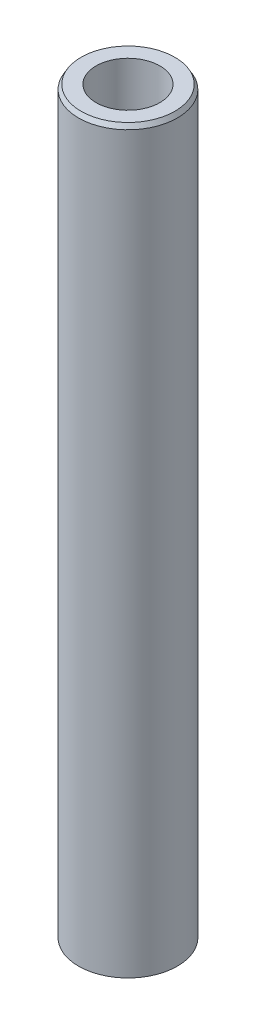
ISO-10303-21;
HEADER;
FILE_DESCRIPTION(('STEP AP214'),'2;1');
FILE_NAME('part.step','',(''),(''),'','','');
FILE_SCHEMA(('AUTOMOTIVE_DESIGN { 1 0 10303 214 1 1 1 1 }'));
ENDSEC;
DATA;
#1=APPLICATION_CONTEXT('core data for automotive mechanical design processes');
#2=APPLICATION_PROTOCOL_DEFINITION('international standard','automotive_design',2000,#1);
#3=PRODUCT_CONTEXT('',#1,'mechanical');
#4=PRODUCT('Part','Part','',(#3));
#5=PRODUCT_RELATED_PRODUCT_CATEGORY('part','',(#4));
#6=PRODUCT_DEFINITION_FORMATION('','',#4);
#7=PRODUCT_DEFINITION_CONTEXT('part definition',#1,'design');
#8=PRODUCT_DEFINITION('design','',#6,#7);
#9=PRODUCT_DEFINITION_SHAPE('','',#8);
#10=(LENGTH_UNIT() NAMED_UNIT(*) SI_UNIT(.MILLI.,.METRE.));
#11=(NAMED_UNIT(*) PLANE_ANGLE_UNIT() SI_UNIT($,.RADIAN.));
#12=(NAMED_UNIT(*) SI_UNIT($,.STERADIAN.) SOLID_ANGLE_UNIT());
#13=UNCERTAINTY_MEASURE_WITH_UNIT(LENGTH_MEASURE(1.E-05),#10,'distance_accuracy_value','');
#14=(GEOMETRIC_REPRESENTATION_CONTEXT(3) GLOBAL_UNCERTAINTY_ASSIGNED_CONTEXT((#13)) GLOBAL_UNIT_ASSIGNED_CONTEXT((#10,
#11,#12)) REPRESENTATION_CONTEXT('',''));
#15=CARTESIAN_POINT('',(0.,0.,0.));
#16=DIRECTION('',(0.,0.,1.));
#17=DIRECTION('',(1.,0.,0.));
#18=AXIS2_PLACEMENT_3D('',#15,#16,#17);
#19=CARTESIAN_POINT('',(0.,600.,0.));
#20=DIRECTION('',(0.,-1.,0.));
#21=DIRECTION('',(0.,0.,-1.));
#22=AXIS2_PLACEMENT_3D('',#19,#20,#21);
#23=CYLINDRICAL_SURFACE('',#22,40.);
#24=CARTESIAN_POINT('',(0.,596.36976541038,0.));
#25=DIRECTION('',(0.,1.,0.));
#26=DIRECTION('',(0.,0.,1.));
#27=AXIS2_PLACEMENT_3D('',#24,#25,#26);
#28=CIRCLE('',#27,40.);
#29=CARTESIAN_POINT('',(0.,596.36976541038,40.));
#30=VERTEX_POINT('',#29);
#31=EDGE_CURVE('E50',#30,#30,#28,.F.);
#32=ORIENTED_EDGE('',*,*,#31,.T.);
#33=EDGE_LOOP('',(#32));
#34=FACE_BOUND('',#33,.T.);
#35=CARTESIAN_POINT('',(0.,2.09591691753863,0.));
#36=DIRECTION('',(0.,1.,0.));
#37=DIRECTION('',(0.,0.,1.));
#38=AXIS2_PLACEMENT_3D('',#35,#36,#37);
#39=CIRCLE('',#38,40.);
#40=CARTESIAN_POINT('',(0.,2.09591691753863,40.));
#41=VERTEX_POINT('',#40);
#42=EDGE_CURVE('E51',#41,#41,#39,.T.);
#43=ORIENTED_EDGE('',*,*,#42,.T.);
#44=EDGE_LOOP('',(#43));
#45=FACE_BOUND('',#44,.T.);
#46=ADVANCED_FACE('F39',(#34,#45),#23,.T.);
#47=CARTESIAN_POINT('',(0.,600.,0.));
#48=DIRECTION('',(0.,1.,0.));
#49=DIRECTION('',(0.,0.,1.));
#50=AXIS2_PLACEMENT_3D('',#47,#48,#49);
#51=PLANE('',#50);
#52=CARTESIAN_POINT('',(0.,600.,0.));
#53=DIRECTION('',(0.,1.,0.));
#54=DIRECTION('',(0.,0.,1.));
#55=AXIS2_PLACEMENT_3D('',#52,#53,#54);
#56=CIRCLE('',#55,37.9040830824616);
#57=CARTESIAN_POINT('',(0.,600.,37.9040830824616));
#58=VERTEX_POINT('',#57);
#59=EDGE_CURVE('E54',#58,#58,#56,.T.);
#60=ORIENTED_EDGE('',*,*,#59,.T.);
#61=EDGE_LOOP('',(#60));
#62=FACE_BOUND('',#61,.T.);
#63=CARTESIAN_POINT('',(0.,600.,0.));
#64=DIRECTION('',(0.,1.,0.));
#65=DIRECTION('',(0.,0.,1.));
#66=AXIS2_PLACEMENT_3D('',#63,#64,#65);
#67=CIRCLE('',#66,25.7955807365798);
#68=CARTESIAN_POINT('',(0.,600.,25.7955807365798));
#69=VERTEX_POINT('',#68);
#70=EDGE_CURVE('E58',#69,#69,#67,.T.);
#71=ORIENTED_EDGE('',*,*,#70,.F.);
#72=EDGE_LOOP('',(#71));
#73=FACE_BOUND('',#72,.T.);
#74=ADVANCED_FACE('F69',(#62,#73),#51,.T.);
#75=CARTESIAN_POINT('',(0.,0.,0.));
#76=DIRECTION('',(0.,1.,0.));
#77=DIRECTION('',(0.,0.,1.));
#78=AXIS2_PLACEMENT_3D('',#75,#76,#77);
#79=PLANE('',#78);
#80=CARTESIAN_POINT('',(0.,0.,0.));
#81=DIRECTION('',(0.,1.,0.));
#82=DIRECTION('',(0.,0.,1.));
#83=AXIS2_PLACEMENT_3D('',#80,#81,#82);
#84=CIRCLE('',#83,36.36976541038);
#85=CARTESIAN_POINT('',(0.,0.,36.36976541038));
#86=VERTEX_POINT('',#85);
#87=EDGE_CURVE('E10',#86,#86,#84,.F.);
#88=ORIENTED_EDGE('',*,*,#87,.T.);
#89=EDGE_LOOP('',(#88));
#90=FACE_BOUND('',#89,.T.);
#91=CARTESIAN_POINT('',(0.,0.,0.));
#92=DIRECTION('',(0.,1.,0.));
#93=DIRECTION('',(0.,0.,1.));
#94=AXIS2_PLACEMENT_3D('',#91,#92,#93);
#95=CIRCLE('',#94,25.7955807365798);
#96=CARTESIAN_POINT('',(0.,0.,25.7955807365798));
#97=VERTEX_POINT('',#96);
#98=EDGE_CURVE('E63',#97,#97,#95,.T.);
#99=ORIENTED_EDGE('',*,*,#98,.T.);
#100=EDGE_LOOP('',(#99));
#101=FACE_BOUND('',#100,.T.);
#102=ADVANCED_FACE('F75',(#90,#101),#79,.F.);
#103=CARTESIAN_POINT('',(0.,600.,0.));
#104=DIRECTION('',(0.,-1.,0.));
#105=DIRECTION('',(0.,0.,-1.));
#106=AXIS2_PLACEMENT_3D('',#103,#104,#105);
#107=CYLINDRICAL_SURFACE('',#106,25.7955807365798);
#108=ORIENTED_EDGE('',*,*,#70,.T.);
#109=EDGE_LOOP('',(#108));
#110=FACE_BOUND('',#109,.T.);
#111=ORIENTED_EDGE('',*,*,#98,.F.);
#112=EDGE_LOOP('',(#111));
#113=FACE_BOUND('',#112,.T.);
#114=ADVANCED_FACE('F70',(#110,#113),#107,.F.);
#115=CARTESIAN_POINT('',(0.,600.,0.));
#116=DIRECTION('',(0.,-1.,0.));
#117=DIRECTION('',(0.,0.,-1.));
#118=AXIS2_PLACEMENT_3D('',#115,#116,#117);
#119=CONICAL_SURFACE('',#118,37.9040830824616,0.523598775598281);
#120=ORIENTED_EDGE('',*,*,#31,.F.);
#121=EDGE_LOOP('',(#120));
#122=FACE_BOUND('',#121,.T.);
#123=ORIENTED_EDGE('',*,*,#59,.F.);
#124=EDGE_LOOP('',(#123));
#125=FACE_BOUND('',#124,.T.);
#126=ADVANCED_FACE('F81',(#122,#125),#119,.T.);
#127=CARTESIAN_POINT('',(0.,2.09591691753863,0.));
#128=DIRECTION('',(0.,1.,0.));
#129=DIRECTION('',(0.,0.,1.));
#130=AXIS2_PLACEMENT_3D('',#127,#128,#129);
#131=CONICAL_SURFACE('',#130,40.,1.04719755119659);
#132=ORIENTED_EDGE('',*,*,#87,.F.);
#133=EDGE_LOOP('',(#132));
#134=FACE_BOUND('',#133,.T.);
#135=ORIENTED_EDGE('',*,*,#42,.F.);
#136=EDGE_LOOP('',(#135));
#137=FACE_BOUND('',#136,.T.);
#138=ADVANCED_FACE('F45',(#134,#137),#131,.T.);
#139=CLOSED_SHELL('',(#46,#74,#102,#114,#126,#138));
#140=MANIFOLD_SOLID_BREP('B2',#139);
#141=ADVANCED_BREP_SHAPE_REPRESENTATION('',(#18,#140),#14);
#142=SHAPE_DEFINITION_REPRESENTATION(#9,#141);
ENDSEC;
END-ISO-10303-21;
